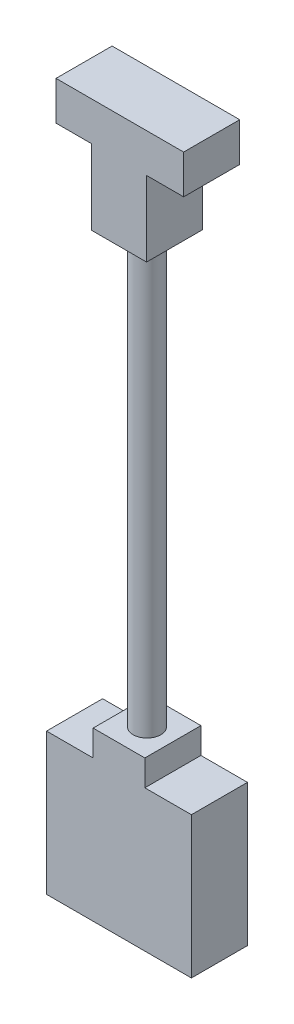
ISO-10303-21;
HEADER;
FILE_DESCRIPTION(('STEP AP214'),'2;1');
FILE_NAME('part.step','',(''),(''),'','','');
FILE_SCHEMA(('AUTOMOTIVE_DESIGN { 1 0 10303 214 1 1 1 1 }'));
ENDSEC;
DATA;
#1=APPLICATION_CONTEXT('core data for automotive mechanical design processes');
#2=APPLICATION_PROTOCOL_DEFINITION('international standard','automotive_design',2000,#1);
#3=PRODUCT_CONTEXT('',#1,'mechanical');
#4=PRODUCT('Part','Part','',(#3));
#5=PRODUCT_RELATED_PRODUCT_CATEGORY('part','',(#4));
#6=PRODUCT_DEFINITION_FORMATION('','',#4);
#7=PRODUCT_DEFINITION_CONTEXT('part definition',#1,'design');
#8=PRODUCT_DEFINITION('design','',#6,#7);
#9=PRODUCT_DEFINITION_SHAPE('','',#8);
#10=(LENGTH_UNIT() NAMED_UNIT(*) SI_UNIT(.MILLI.,.METRE.));
#11=(NAMED_UNIT(*) PLANE_ANGLE_UNIT() SI_UNIT($,.RADIAN.));
#12=(NAMED_UNIT(*) SI_UNIT($,.STERADIAN.) SOLID_ANGLE_UNIT());
#13=UNCERTAINTY_MEASURE_WITH_UNIT(LENGTH_MEASURE(1.E-05),#10,'distance_accuracy_value','');
#14=(GEOMETRIC_REPRESENTATION_CONTEXT(3) GLOBAL_UNCERTAINTY_ASSIGNED_CONTEXT((#13)) GLOBAL_UNIT_ASSIGNED_CONTEXT((#10,
#11,#12)) REPRESENTATION_CONTEXT('',''));
#15=CARTESIAN_POINT('',(0.,0.,0.));
#16=DIRECTION('',(0.,0.,1.));
#17=DIRECTION('',(1.,0.,0.));
#18=AXIS2_PLACEMENT_3D('',#15,#16,#17);
#19=CARTESIAN_POINT('',(16.5771568468043,-27.9499999999985,3.25));
#20=DIRECTION('',(0.,1.,0.));
#21=DIRECTION('',(0.,0.,1.));
#22=AXIS2_PLACEMENT_3D('',#19,#20,#21);
#23=CYLINDRICAL_SURFACE('',#22,1.6);
#24=CARTESIAN_POINT('',(16.5771568468043,27.0500000000015,3.25));
#25=DIRECTION('',(0.,-1.,0.));
#26=DIRECTION('',(0.,0.,-1.));
#27=AXIS2_PLACEMENT_3D('',#24,#25,#26);
#28=CIRCLE('',#27,1.6);
#29=CARTESIAN_POINT('',(16.5771568468043,27.0500000000015,1.65));
#30=VERTEX_POINT('',#29);
#31=EDGE_CURVE('E42',#30,#30,#28,.T.);
#32=ORIENTED_EDGE('',*,*,#31,.T.);
#33=EDGE_LOOP('',(#32));
#34=FACE_BOUND('',#33,.T.);
#35=CARTESIAN_POINT('',(16.5771568468043,-22.8500000000003,3.25));
#36=DIRECTION('',(0.,-1.,0.));
#37=DIRECTION('',(0.,0.,-1.));
#38=AXIS2_PLACEMENT_3D('',#35,#36,#37);
#39=CIRCLE('',#38,1.6);
#40=CARTESIAN_POINT('',(16.5771568468043,-22.8500000000003,1.65));
#41=VERTEX_POINT('',#40);
#42=EDGE_CURVE('E11',#41,#41,#39,.T.);
#43=ORIENTED_EDGE('',*,*,#42,.F.);
#44=EDGE_LOOP('',(#43));
#45=FACE_BOUND('',#44,.T.);
#46=ADVANCED_FACE('F33',(#34,#45),#23,.T.);
#47=CARTESIAN_POINT('',(13.3771568468043,27.0500000000015,6.5));
#48=DIRECTION('',(0.,1.,0.));
#49=DIRECTION('',(0.,0.,1.));
#50=AXIS2_PLACEMENT_3D('',#47,#48,#49);
#51=PLANE('',#50);
#52=ORIENTED_EDGE('',*,*,#31,.F.);
#53=EDGE_LOOP('',(#52));
#54=FACE_BOUND('',#53,.T.);
#55=DIRECTION('',(1.,0.,0.));
#56=VECTOR('',#55,1.);
#57=CARTESIAN_POINT('',(13.3771568468043,27.0500000000015,0.));
#58=LINE('',#57,#56);
#59=CARTESIAN_POINT('',(13.3771568468043,27.0500000000015,0.));
#60=VERTEX_POINT('',#59);
#61=CARTESIAN_POINT('',(19.7771568468043,27.0500000000015,0.));
#62=VERTEX_POINT('',#61);
#63=EDGE_CURVE('E135',#60,#62,#58,.T.);
#64=ORIENTED_EDGE('',*,*,#63,.T.);
#65=DIRECTION('',(0.,0.,-1.));
#66=VECTOR('',#65,1.);
#67=CARTESIAN_POINT('',(19.7771568468043,27.0500000000015,6.5));
#68=LINE('',#67,#66);
#69=CARTESIAN_POINT('',(19.7771568468043,27.0500000000015,6.5));
#70=VERTEX_POINT('',#69);
#71=EDGE_CURVE('E162',#70,#62,#68,.T.);
#72=ORIENTED_EDGE('',*,*,#71,.F.);
#73=DIRECTION('',(1.,0.,0.));
#74=VECTOR('',#73,1.);
#75=CARTESIAN_POINT('',(13.3771568468043,27.0500000000015,6.5));
#76=LINE('',#75,#74);
#77=CARTESIAN_POINT('',(13.3771568468043,27.0500000000015,6.5));
#78=VERTEX_POINT('',#77);
#79=EDGE_CURVE('E150',#78,#70,#76,.T.);
#80=ORIENTED_EDGE('',*,*,#79,.F.);
#81=DIRECTION('',(0.,0.,-1.));
#82=VECTOR('',#81,1.);
#83=CARTESIAN_POINT('',(13.3771568468043,27.0500000000015,6.5));
#84=LINE('',#83,#82);
#85=EDGE_CURVE('E131',#78,#60,#84,.T.);
#86=ORIENTED_EDGE('',*,*,#85,.T.);
#87=EDGE_LOOP('',(#64,#72,#80,#86));
#88=FACE_BOUND('',#87,.T.);
#89=ADVANCED_FACE('F35',(#54,#88),#51,.F.);
#90=CARTESIAN_POINT('',(19.7771568468043,27.0500000000015,6.5));
#91=DIRECTION('',(-1.,0.,0.));
#92=DIRECTION('',(0.,0.,1.));
#93=AXIS2_PLACEMENT_3D('',#90,#91,#92);
#94=PLANE('',#93);
#95=DIRECTION('',(0.,1.,0.));
#96=VECTOR('',#95,1.);
#97=CARTESIAN_POINT('',(19.7771568468043,27.0500000000015,0.));
#98=LINE('',#97,#96);
#99=CARTESIAN_POINT('',(19.7771568468043,35.7500000000015,0.));
#100=VERTEX_POINT('',#99);
#101=EDGE_CURVE('E138',#62,#100,#98,.T.);
#102=ORIENTED_EDGE('',*,*,#101,.T.);
#103=DIRECTION('',(0.,0.,-1.));
#104=VECTOR('',#103,1.);
#105=CARTESIAN_POINT('',(19.7771568468043,35.7500000000015,6.5));
#106=LINE('',#105,#104);
#107=CARTESIAN_POINT('',(19.7771568468043,35.7500000000015,6.5));
#108=VERTEX_POINT('',#107);
#109=EDGE_CURVE('E160',#108,#100,#106,.T.);
#110=ORIENTED_EDGE('',*,*,#109,.F.);
#111=DIRECTION('',(0.,1.,0.));
#112=VECTOR('',#111,1.);
#113=CARTESIAN_POINT('',(19.7771568468043,27.0500000000015,6.5));
#114=LINE('',#113,#112);
#115=EDGE_CURVE('E95',#70,#108,#114,.T.);
#116=ORIENTED_EDGE('',*,*,#115,.F.);
#117=ORIENTED_EDGE('',*,*,#71,.T.);
#118=EDGE_LOOP('',(#102,#110,#116,#117));
#119=FACE_BOUND('',#118,.T.);
#120=ADVANCED_FACE('F207',(#119),#94,.F.);
#121=CARTESIAN_POINT('',(19.7771568468043,35.7500000000015,6.5));
#122=DIRECTION('',(0.,1.,0.));
#123=DIRECTION('',(0.,0.,1.));
#124=AXIS2_PLACEMENT_3D('',#121,#122,#123);
#125=PLANE('',#124);
#126=DIRECTION('',(1.,0.,0.));
#127=VECTOR('',#126,1.);
#128=CARTESIAN_POINT('',(19.7771568468043,35.7500000000015,0.));
#129=LINE('',#128,#127);
#130=CARTESIAN_POINT('',(24.0771568468043,35.7500000000015,0.));
#131=VERTEX_POINT('',#130);
#132=EDGE_CURVE('E141',#100,#131,#129,.T.);
#133=ORIENTED_EDGE('',*,*,#132,.T.);
#134=DIRECTION('',(0.,0.,-1.));
#135=VECTOR('',#134,1.);
#136=CARTESIAN_POINT('',(24.0771568468043,35.7500000000015,6.5));
#137=LINE('',#136,#135);
#138=CARTESIAN_POINT('',(24.0771568468043,35.7500000000015,6.5));
#139=VERTEX_POINT('',#138);
#140=EDGE_CURVE('E157',#139,#131,#137,.T.);
#141=ORIENTED_EDGE('',*,*,#140,.F.);
#142=DIRECTION('',(1.,0.,0.));
#143=VECTOR('',#142,1.);
#144=CARTESIAN_POINT('',(19.7771568468043,35.7500000000015,6.5));
#145=LINE('',#144,#143);
#146=EDGE_CURVE('E173',#108,#139,#145,.T.);
#147=ORIENTED_EDGE('',*,*,#146,.F.);
#148=ORIENTED_EDGE('',*,*,#109,.T.);
#149=EDGE_LOOP('',(#133,#141,#147,#148));
#150=FACE_BOUND('',#149,.T.);
#151=ADVANCED_FACE('F485',(#150),#125,.F.);
#152=CARTESIAN_POINT('',(24.0771568468043,35.7500000000015,6.5));
#153=DIRECTION('',(-1.,0.,0.));
#154=DIRECTION('',(0.,0.,1.));
#155=AXIS2_PLACEMENT_3D('',#152,#153,#154);
#156=PLANE('',#155);
#157=DIRECTION('',(0.,1.,0.));
#158=VECTOR('',#157,1.);
#159=CARTESIAN_POINT('',(24.0771568468043,35.7500000000015,0.));
#160=LINE('',#159,#158);
#161=CARTESIAN_POINT('',(24.0771568468043,40.2500000000017,0.));
#162=VERTEX_POINT('',#161);
#163=EDGE_CURVE('E143',#131,#162,#160,.T.);
#164=ORIENTED_EDGE('',*,*,#163,.T.);
#165=DIRECTION('',(0.,0.,-1.));
#166=VECTOR('',#165,1.);
#167=CARTESIAN_POINT('',(24.0771568468043,40.2500000000017,6.5));
#168=LINE('',#167,#166);
#169=CARTESIAN_POINT('',(24.0771568468043,40.2500000000017,6.5));
#170=VERTEX_POINT('',#169);
#171=EDGE_CURVE('E154',#170,#162,#168,.T.);
#172=ORIENTED_EDGE('',*,*,#171,.F.);
#173=DIRECTION('',(0.,1.,0.));
#174=VECTOR('',#173,1.);
#175=CARTESIAN_POINT('',(24.0771568468043,35.7500000000015,6.5));
#176=LINE('',#175,#174);
#177=EDGE_CURVE('E175',#139,#170,#176,.T.);
#178=ORIENTED_EDGE('',*,*,#177,.F.);
#179=ORIENTED_EDGE('',*,*,#140,.T.);
#180=EDGE_LOOP('',(#164,#172,#178,#179));
#181=FACE_BOUND('',#180,.T.);
#182=ADVANCED_FACE('F181',(#181),#156,.F.);
#183=CARTESIAN_POINT('',(24.0771568468043,40.2500000000017,6.5));
#184=DIRECTION('',(0.,-1.,0.));
#185=DIRECTION('',(0.,0.,-1.));
#186=AXIS2_PLACEMENT_3D('',#183,#184,#185);
#187=PLANE('',#186);
#188=DIRECTION('',(-1.,0.,0.));
#189=VECTOR('',#188,1.);
#190=CARTESIAN_POINT('',(24.0771568468043,40.2500000000017,0.));
#191=LINE('',#190,#189);
#192=CARTESIAN_POINT('',(9.27715684680433,40.2500000000017,0.));
#193=VERTEX_POINT('',#192);
#194=EDGE_CURVE('E145',#162,#193,#191,.T.);
#195=ORIENTED_EDGE('',*,*,#194,.T.);
#196=DIRECTION('',(0.,0.,-1.));
#197=VECTOR('',#196,1.);
#198=CARTESIAN_POINT('',(9.27715684680433,40.2500000000017,6.5));
#199=LINE('',#198,#197);
#200=CARTESIAN_POINT('',(9.27715684680433,40.2500000000017,6.5));
#201=VERTEX_POINT('',#200);
#202=EDGE_CURVE('E126',#201,#193,#199,.T.);
#203=ORIENTED_EDGE('',*,*,#202,.F.);
#204=DIRECTION('',(-1.,0.,0.));
#205=VECTOR('',#204,1.);
#206=CARTESIAN_POINT('',(24.0771568468043,40.2500000000017,6.5));
#207=LINE('',#206,#205);
#208=EDGE_CURVE('E117',#170,#201,#207,.T.);
#209=ORIENTED_EDGE('',*,*,#208,.F.);
#210=ORIENTED_EDGE('',*,*,#171,.T.);
#211=EDGE_LOOP('',(#195,#203,#209,#210));
#212=FACE_BOUND('',#211,.T.);
#213=ADVANCED_FACE('F185',(#212),#187,.F.);
#214=CARTESIAN_POINT('',(9.27715684680433,40.2500000000017,6.5));
#215=DIRECTION('',(1.,0.,0.));
#216=DIRECTION('',(0.,0.,-1.));
#217=AXIS2_PLACEMENT_3D('',#214,#215,#216);
#218=PLANE('',#217);
#219=DIRECTION('',(0.,-1.,0.));
#220=VECTOR('',#219,1.);
#221=CARTESIAN_POINT('',(9.27715684680433,40.2500000000017,0.));
#222=LINE('',#221,#220);
#223=CARTESIAN_POINT('',(9.27715684680433,35.7500000000015,0.));
#224=VERTEX_POINT('',#223);
#225=EDGE_CURVE('E125',#193,#224,#222,.T.);
#226=ORIENTED_EDGE('',*,*,#225,.T.);
#227=DIRECTION('',(0.,0.,-1.));
#228=VECTOR('',#227,1.);
#229=CARTESIAN_POINT('',(9.27715684680433,35.7500000000015,6.5));
#230=LINE('',#229,#228);
#231=CARTESIAN_POINT('',(9.27715684680433,35.7500000000015,6.5));
#232=VERTEX_POINT('',#231);
#233=EDGE_CURVE('E122',#232,#224,#230,.T.);
#234=ORIENTED_EDGE('',*,*,#233,.F.);
#235=DIRECTION('',(0.,-1.,0.));
#236=VECTOR('',#235,1.);
#237=CARTESIAN_POINT('',(9.27715684680433,40.2500000000017,6.5));
#238=LINE('',#237,#236);
#239=EDGE_CURVE('E111',#201,#232,#238,.T.);
#240=ORIENTED_EDGE('',*,*,#239,.F.);
#241=ORIENTED_EDGE('',*,*,#202,.T.);
#242=EDGE_LOOP('',(#226,#234,#240,#241));
#243=FACE_BOUND('',#242,.T.);
#244=ADVANCED_FACE('F123',(#243),#218,.F.);
#245=CARTESIAN_POINT('',(9.27715684680433,35.7500000000015,6.5));
#246=DIRECTION('',(0.,1.,0.));
#247=DIRECTION('',(0.,0.,1.));
#248=AXIS2_PLACEMENT_3D('',#245,#246,#247);
#249=PLANE('',#248);
#250=DIRECTION('',(1.,0.,0.));
#251=VECTOR('',#250,1.);
#252=CARTESIAN_POINT('',(9.27715684680433,35.7500000000015,0.));
#253=LINE('',#252,#251);
#254=CARTESIAN_POINT('',(13.3771568468043,35.7500000000015,0.));
#255=VERTEX_POINT('',#254);
#256=EDGE_CURVE('E80',#224,#255,#253,.T.);
#257=ORIENTED_EDGE('',*,*,#256,.T.);
#258=DIRECTION('',(0.,0.,-1.));
#259=VECTOR('',#258,1.);
#260=CARTESIAN_POINT('',(13.3771568468043,35.7500000000015,6.5));
#261=LINE('',#260,#259);
#262=CARTESIAN_POINT('',(13.3771568468043,35.7500000000015,6.5));
#263=VERTEX_POINT('',#262);
#264=EDGE_CURVE('E127',#263,#255,#261,.T.);
#265=ORIENTED_EDGE('',*,*,#264,.F.);
#266=DIRECTION('',(1.,0.,0.));
#267=VECTOR('',#266,1.);
#268=CARTESIAN_POINT('',(9.27715684680433,35.7500000000015,6.5));
#269=LINE('',#268,#267);
#270=EDGE_CURVE('E115',#232,#263,#269,.T.);
#271=ORIENTED_EDGE('',*,*,#270,.F.);
#272=ORIENTED_EDGE('',*,*,#233,.T.);
#273=EDGE_LOOP('',(#257,#265,#271,#272));
#274=FACE_BOUND('',#273,.T.);
#275=ADVANCED_FACE('F129',(#274),#249,.F.);
#276=CARTESIAN_POINT('',(13.3771568468043,35.7500000000015,6.5));
#277=DIRECTION('',(1.,0.,0.));
#278=DIRECTION('',(0.,0.,-1.));
#279=AXIS2_PLACEMENT_3D('',#276,#277,#278);
#280=PLANE('',#279);
#281=DIRECTION('',(0.,-1.,0.));
#282=VECTOR('',#281,1.);
#283=CARTESIAN_POINT('',(13.3771568468043,35.7500000000015,0.));
#284=LINE('',#283,#282);
#285=EDGE_CURVE('E86',#255,#60,#284,.T.);
#286=ORIENTED_EDGE('',*,*,#285,.T.);
#287=ORIENTED_EDGE('',*,*,#85,.F.);
#288=DIRECTION('',(0.,-1.,0.));
#289=VECTOR('',#288,1.);
#290=CARTESIAN_POINT('',(13.3771568468043,35.7500000000015,6.5));
#291=LINE('',#290,#289);
#292=EDGE_CURVE('E50',#263,#78,#291,.T.);
#293=ORIENTED_EDGE('',*,*,#292,.F.);
#294=ORIENTED_EDGE('',*,*,#264,.T.);
#295=EDGE_LOOP('',(#286,#287,#293,#294));
#296=FACE_BOUND('',#295,.T.);
#297=ADVANCED_FACE('F192',(#296),#280,.F.);
#298=CARTESIAN_POINT('',(0.,0.,6.5));
#299=DIRECTION('',(0.,0.,1.));
#300=DIRECTION('',(1.,0.,0.));
#301=AXIS2_PLACEMENT_3D('',#298,#299,#300);
#302=PLANE('',#301);
#303=ORIENTED_EDGE('',*,*,#79,.T.);
#304=ORIENTED_EDGE('',*,*,#115,.T.);
#305=ORIENTED_EDGE('',*,*,#146,.T.);
#306=ORIENTED_EDGE('',*,*,#177,.T.);
#307=ORIENTED_EDGE('',*,*,#208,.T.);
#308=ORIENTED_EDGE('',*,*,#239,.T.);
#309=ORIENTED_EDGE('',*,*,#270,.T.);
#310=ORIENTED_EDGE('',*,*,#292,.T.);
#311=EDGE_LOOP('',(#303,#304,#305,#306,#307,#308,#309,#310));
#312=FACE_BOUND('',#311,.T.);
#313=ADVANCED_FACE('F113',(#312),#302,.T.);
#314=CARTESIAN_POINT('',(0.,0.,0.));
#315=DIRECTION('',(0.,0.,1.));
#316=DIRECTION('',(1.,0.,0.));
#317=AXIS2_PLACEMENT_3D('',#314,#315,#316);
#318=PLANE('',#317);
#319=ORIENTED_EDGE('',*,*,#63,.F.);
#320=ORIENTED_EDGE('',*,*,#285,.F.);
#321=ORIENTED_EDGE('',*,*,#256,.F.);
#322=ORIENTED_EDGE('',*,*,#225,.F.);
#323=ORIENTED_EDGE('',*,*,#194,.F.);
#324=ORIENTED_EDGE('',*,*,#163,.F.);
#325=ORIENTED_EDGE('',*,*,#132,.F.);
#326=ORIENTED_EDGE('',*,*,#101,.F.);
#327=EDGE_LOOP('',(#319,#320,#321,#322,#323,#324,#325,#326));
#328=FACE_BOUND('',#327,.T.);
#329=ADVANCED_FACE('F188',(#328),#318,.F.);
#330=CARTESIAN_POINT('',(8.17715684680399,-42.2500000000014,6.5));
#331=DIRECTION('',(0.,1.,0.));
#332=DIRECTION('',(0.,0.,1.));
#333=AXIS2_PLACEMENT_3D('',#330,#331,#332);
#334=PLANE('',#333);
#335=DIRECTION('',(1.,0.,0.));
#336=VECTOR('',#335,1.);
#337=CARTESIAN_POINT('',(8.17715684680399,-42.2500000000014,0.));
#338=LINE('',#337,#336);
#339=CARTESIAN_POINT('',(8.17715684680399,-42.2500000000014,0.));
#340=VERTEX_POINT('',#339);
#341=CARTESIAN_POINT('',(24.977156846804,-42.2500000000014,0.));
#342=VERTEX_POINT('',#341);
#343=EDGE_CURVE('E229',#340,#342,#338,.T.);
#344=ORIENTED_EDGE('',*,*,#343,.T.);
#345=DIRECTION('',(0.,0.,-1.));
#346=VECTOR('',#345,1.);
#347=CARTESIAN_POINT('',(24.977156846804,-42.2500000000014,6.5));
#348=LINE('',#347,#346);
#349=CARTESIAN_POINT('',(24.977156846804,-42.2500000000014,6.5));
#350=VERTEX_POINT('',#349);
#351=EDGE_CURVE('E139',#350,#342,#348,.T.);
#352=ORIENTED_EDGE('',*,*,#351,.F.);
#353=DIRECTION('',(1.,0.,0.));
#354=VECTOR('',#353,1.);
#355=CARTESIAN_POINT('',(8.17715684680399,-42.2500000000014,6.5));
#356=LINE('',#355,#354);
#357=CARTESIAN_POINT('',(8.17715684680399,-42.2500000000014,6.5));
#358=VERTEX_POINT('',#357);
#359=EDGE_CURVE('E266',#358,#350,#356,.T.);
#360=ORIENTED_EDGE('',*,*,#359,.F.);
#361=DIRECTION('',(0.,0.,-1.));
#362=VECTOR('',#361,1.);
#363=CARTESIAN_POINT('',(8.17715684680399,-42.2500000000014,6.5));
#364=LINE('',#363,#362);
#365=EDGE_CURVE('E234',#358,#340,#364,.T.);
#366=ORIENTED_EDGE('',*,*,#365,.T.);
#367=EDGE_LOOP('',(#344,#352,#360,#366));
#368=FACE_BOUND('',#367,.T.);
#369=ADVANCED_FACE('F211',(#368),#334,.F.);
#370=CARTESIAN_POINT('',(24.977156846804,-42.2500000000014,6.5));
#371=DIRECTION('',(-1.,0.,0.));
#372=DIRECTION('',(0.,0.,1.));
#373=AXIS2_PLACEMENT_3D('',#370,#371,#372);
#374=PLANE('',#373);
#375=DIRECTION('',(0.,1.,0.));
#376=VECTOR('',#375,1.);
#377=CARTESIAN_POINT('',(24.977156846804,-42.2500000000014,0.));
#378=LINE('',#377,#376);
#379=CARTESIAN_POINT('',(24.977156846804,-25.8500000000012,0.));
#380=VERTEX_POINT('',#379);
#381=EDGE_CURVE('E240',#342,#380,#378,.T.);
#382=ORIENTED_EDGE('',*,*,#381,.T.);
#383=DIRECTION('',(0.,0.,-1.));
#384=VECTOR('',#383,1.);
#385=CARTESIAN_POINT('',(24.977156846804,-25.8500000000012,6.5));
#386=LINE('',#385,#384);
#387=CARTESIAN_POINT('',(24.977156846804,-25.8500000000012,6.5));
#388=VERTEX_POINT('',#387);
#389=EDGE_CURVE('E282',#388,#380,#386,.T.);
#390=ORIENTED_EDGE('',*,*,#389,.F.);
#391=DIRECTION('',(0.,1.,0.));
#392=VECTOR('',#391,1.);
#393=CARTESIAN_POINT('',(24.977156846804,-42.2500000000014,6.5));
#394=LINE('',#393,#392);
#395=EDGE_CURVE('E290',#350,#388,#394,.T.);
#396=ORIENTED_EDGE('',*,*,#395,.F.);
#397=ORIENTED_EDGE('',*,*,#351,.T.);
#398=EDGE_LOOP('',(#382,#390,#396,#397));
#399=FACE_BOUND('',#398,.T.);
#400=ADVANCED_FACE('F217',(#399),#374,.F.);
#401=CARTESIAN_POINT('',(24.977156846804,-25.8500000000012,6.5));
#402=DIRECTION('',(0.,-1.,0.));
#403=DIRECTION('',(0.,0.,-1.));
#404=AXIS2_PLACEMENT_3D('',#401,#402,#403);
#405=PLANE('',#404);
#406=DIRECTION('',(-1.,0.,0.));
#407=VECTOR('',#406,1.);
#408=CARTESIAN_POINT('',(24.977156846804,-25.8500000000012,0.));
#409=LINE('',#408,#407);
#410=CARTESIAN_POINT('',(19.577156846804,-25.8500000000012,0.));
#411=VERTEX_POINT('',#410);
#412=EDGE_CURVE('E243',#380,#411,#409,.T.);
#413=ORIENTED_EDGE('',*,*,#412,.T.);
#414=DIRECTION('',(0.,0.,-1.));
#415=VECTOR('',#414,1.);
#416=CARTESIAN_POINT('',(19.577156846804,-25.8500000000012,6.5));
#417=LINE('',#416,#415);
#418=CARTESIAN_POINT('',(19.577156846804,-25.8500000000012,6.5));
#419=VERTEX_POINT('',#418);
#420=EDGE_CURVE('E280',#419,#411,#417,.T.);
#421=ORIENTED_EDGE('',*,*,#420,.F.);
#422=DIRECTION('',(-1.,0.,0.));
#423=VECTOR('',#422,1.);
#424=CARTESIAN_POINT('',(24.977156846804,-25.8500000000012,6.5));
#425=LINE('',#424,#423);
#426=EDGE_CURVE('E296',#388,#419,#425,.T.);
#427=ORIENTED_EDGE('',*,*,#426,.F.);
#428=ORIENTED_EDGE('',*,*,#389,.T.);
#429=EDGE_LOOP('',(#413,#421,#427,#428));
#430=FACE_BOUND('',#429,.T.);
#431=ADVANCED_FACE('F222',(#430),#405,.F.);
#432=CARTESIAN_POINT('',(19.577156846804,-25.8500000000012,6.5));
#433=DIRECTION('',(-1.,0.,0.));
#434=DIRECTION('',(0.,0.,1.));
#435=AXIS2_PLACEMENT_3D('',#432,#433,#434);
#436=PLANE('',#435);
#437=DIRECTION('',(0.,1.,0.));
#438=VECTOR('',#437,1.);
#439=CARTESIAN_POINT('',(19.577156846804,-25.8500000000012,0.));
#440=LINE('',#439,#438);
#441=CARTESIAN_POINT('',(19.577156846804,-22.8500000000003,0.));
#442=VERTEX_POINT('',#441);
#443=EDGE_CURVE('E251',#411,#442,#440,.T.);
#444=ORIENTED_EDGE('',*,*,#443,.T.);
#445=DIRECTION('',(0.,0.,-1.));
#446=VECTOR('',#445,1.);
#447=CARTESIAN_POINT('',(19.577156846804,-22.8500000000003,6.5));
#448=LINE('',#447,#446);
#449=CARTESIAN_POINT('',(19.577156846804,-22.8500000000003,6.5));
#450=VERTEX_POINT('',#449);
#451=EDGE_CURVE('E277',#450,#442,#448,.T.);
#452=ORIENTED_EDGE('',*,*,#451,.F.);
#453=DIRECTION('',(0.,1.,0.));
#454=VECTOR('',#453,1.);
#455=CARTESIAN_POINT('',(19.577156846804,-25.8500000000012,6.5));
#456=LINE('',#455,#454);
#457=EDGE_CURVE('E305',#419,#450,#456,.T.);
#458=ORIENTED_EDGE('',*,*,#457,.F.);
#459=ORIENTED_EDGE('',*,*,#420,.T.);
#460=EDGE_LOOP('',(#444,#452,#458,#459));
#461=FACE_BOUND('',#460,.T.);
#462=ADVANCED_FACE('F360',(#461),#436,.F.);
#463=CARTESIAN_POINT('',(19.577156846804,-22.8500000000003,6.5));
#464=DIRECTION('',(0.,-1.,0.));
#465=DIRECTION('',(0.,0.,-1.));
#466=AXIS2_PLACEMENT_3D('',#463,#464,#465);
#467=PLANE('',#466);
#468=ORIENTED_EDGE('',*,*,#42,.T.);
#469=EDGE_LOOP('',(#468));
#470=FACE_BOUND('',#469,.T.);
#471=DIRECTION('',(-1.,0.,0.));
#472=VECTOR('',#471,1.);
#473=CARTESIAN_POINT('',(19.577156846804,-22.8500000000003,0.));
#474=LINE('',#473,#472);
#475=CARTESIAN_POINT('',(13.577156846804,-22.8500000000003,0.));
#476=VERTEX_POINT('',#475);
#477=EDGE_CURVE('E254',#442,#476,#474,.T.);
#478=ORIENTED_EDGE('',*,*,#477,.T.);
#479=DIRECTION('',(0.,0.,-1.));
#480=VECTOR('',#479,1.);
#481=CARTESIAN_POINT('',(13.577156846804,-22.8500000000003,6.5));
#482=LINE('',#481,#480);
#483=CARTESIAN_POINT('',(13.577156846804,-22.8500000000003,6.5));
#484=VERTEX_POINT('',#483);
#485=EDGE_CURVE('E274',#484,#476,#482,.T.);
#486=ORIENTED_EDGE('',*,*,#485,.F.);
#487=DIRECTION('',(-1.,0.,0.));
#488=VECTOR('',#487,1.);
#489=CARTESIAN_POINT('',(19.577156846804,-22.8500000000003,6.5));
#490=LINE('',#489,#488);
#491=EDGE_CURVE('E308',#450,#484,#490,.T.);
#492=ORIENTED_EDGE('',*,*,#491,.F.);
#493=ORIENTED_EDGE('',*,*,#451,.T.);
#494=EDGE_LOOP('',(#478,#486,#492,#493));
#495=FACE_BOUND('',#494,.T.);
#496=ADVANCED_FACE('F357',(#470,#495),#467,.F.);
#497=CARTESIAN_POINT('',(13.577156846804,-22.8500000000003,6.5));
#498=DIRECTION('',(1.,0.,0.));
#499=DIRECTION('',(0.,0.,-1.));
#500=AXIS2_PLACEMENT_3D('',#497,#498,#499);
#501=PLANE('',#500);
#502=DIRECTION('',(0.,-1.,0.));
#503=VECTOR('',#502,1.);
#504=CARTESIAN_POINT('',(13.577156846804,-22.8500000000003,0.));
#505=LINE('',#504,#503);
#506=CARTESIAN_POINT('',(13.577156846804,-25.8500000000012,0.));
#507=VERTEX_POINT('',#506);
#508=EDGE_CURVE('E257',#476,#507,#505,.T.);
#509=ORIENTED_EDGE('',*,*,#508,.T.);
#510=DIRECTION('',(0.,0.,-1.));
#511=VECTOR('',#510,1.);
#512=CARTESIAN_POINT('',(13.577156846804,-25.8500000000012,6.5));
#513=LINE('',#512,#511);
#514=CARTESIAN_POINT('',(13.577156846804,-25.8500000000012,6.5));
#515=VERTEX_POINT('',#514);
#516=EDGE_CURVE('E271',#515,#507,#513,.T.);
#517=ORIENTED_EDGE('',*,*,#516,.F.);
#518=DIRECTION('',(0.,-1.,0.));
#519=VECTOR('',#518,1.);
#520=CARTESIAN_POINT('',(13.577156846804,-22.8500000000003,6.5));
#521=LINE('',#520,#519);
#522=EDGE_CURVE('E311',#484,#515,#521,.T.);
#523=ORIENTED_EDGE('',*,*,#522,.F.);
#524=ORIENTED_EDGE('',*,*,#485,.T.);
#525=EDGE_LOOP('',(#509,#517,#523,#524));
#526=FACE_BOUND('',#525,.T.);
#527=ADVANCED_FACE('F340',(#526),#501,.F.);
#528=CARTESIAN_POINT('',(13.577156846804,-25.8500000000012,6.5));
#529=DIRECTION('',(0.,-1.,0.));
#530=DIRECTION('',(0.,0.,-1.));
#531=AXIS2_PLACEMENT_3D('',#528,#529,#530);
#532=PLANE('',#531);
#533=DIRECTION('',(-1.,0.,0.));
#534=VECTOR('',#533,1.);
#535=CARTESIAN_POINT('',(13.577156846804,-25.8500000000012,0.));
#536=LINE('',#535,#534);
#537=CARTESIAN_POINT('',(8.17715684680399,-25.8500000000012,0.));
#538=VERTEX_POINT('',#537);
#539=EDGE_CURVE('E260',#507,#538,#536,.T.);
#540=ORIENTED_EDGE('',*,*,#539,.T.);
#541=DIRECTION('',(0.,0.,-1.));
#542=VECTOR('',#541,1.);
#543=CARTESIAN_POINT('',(8.17715684680399,-25.8500000000012,6.5));
#544=LINE('',#543,#542);
#545=CARTESIAN_POINT('',(8.17715684680399,-25.8500000000012,6.5));
#546=VERTEX_POINT('',#545);
#547=EDGE_CURVE('E268',#546,#538,#544,.T.);
#548=ORIENTED_EDGE('',*,*,#547,.F.);
#549=DIRECTION('',(-1.,0.,0.));
#550=VECTOR('',#549,1.);
#551=CARTESIAN_POINT('',(13.577156846804,-25.8500000000012,6.5));
#552=LINE('',#551,#550);
#553=EDGE_CURVE('E313',#515,#546,#552,.T.);
#554=ORIENTED_EDGE('',*,*,#553,.F.);
#555=ORIENTED_EDGE('',*,*,#516,.T.);
#556=EDGE_LOOP('',(#540,#548,#554,#555));
#557=FACE_BOUND('',#556,.T.);
#558=ADVANCED_FACE('F322',(#557),#532,.F.);
#559=CARTESIAN_POINT('',(8.17715684680399,-25.8500000000012,6.5));
#560=DIRECTION('',(1.,0.,0.));
#561=DIRECTION('',(0.,0.,-1.));
#562=AXIS2_PLACEMENT_3D('',#559,#560,#561);
#563=PLANE('',#562);
#564=DIRECTION('',(0.,-1.,0.));
#565=VECTOR('',#564,1.);
#566=CARTESIAN_POINT('',(8.17715684680399,-25.8500000000012,0.));
#567=LINE('',#566,#565);
#568=EDGE_CURVE('E263',#538,#340,#567,.T.);
#569=ORIENTED_EDGE('',*,*,#568,.T.);
#570=ORIENTED_EDGE('',*,*,#365,.F.);
#571=DIRECTION('',(0.,-1.,0.));
#572=VECTOR('',#571,1.);
#573=CARTESIAN_POINT('',(8.17715684680399,-25.8500000000012,6.5));
#574=LINE('',#573,#572);
#575=EDGE_CURVE('E246',#546,#358,#574,.T.);
#576=ORIENTED_EDGE('',*,*,#575,.F.);
#577=ORIENTED_EDGE('',*,*,#547,.T.);
#578=EDGE_LOOP('',(#569,#570,#576,#577));
#579=FACE_BOUND('',#578,.T.);
#580=ADVANCED_FACE('F326',(#579),#563,.F.);
#581=CARTESIAN_POINT('',(0.,0.,6.5));
#582=DIRECTION('',(0.,0.,1.));
#583=DIRECTION('',(1.,0.,0.));
#584=AXIS2_PLACEMENT_3D('',#581,#582,#583);
#585=PLANE('',#584);
#586=ORIENTED_EDGE('',*,*,#359,.T.);
#587=ORIENTED_EDGE('',*,*,#395,.T.);
#588=ORIENTED_EDGE('',*,*,#426,.T.);
#589=ORIENTED_EDGE('',*,*,#457,.T.);
#590=ORIENTED_EDGE('',*,*,#491,.T.);
#591=ORIENTED_EDGE('',*,*,#522,.T.);
#592=ORIENTED_EDGE('',*,*,#553,.T.);
#593=ORIENTED_EDGE('',*,*,#575,.T.);
#594=EDGE_LOOP('',(#586,#587,#588,#589,#590,#591,#592,#593));
#595=FACE_BOUND('',#594,.T.);
#596=ADVANCED_FACE('F299',(#595),#585,.T.);
#597=CARTESIAN_POINT('',(0.,0.,0.));
#598=DIRECTION('',(0.,0.,1.));
#599=DIRECTION('',(1.,0.,0.));
#600=AXIS2_PLACEMENT_3D('',#597,#598,#599);
#601=PLANE('',#600);
#602=ORIENTED_EDGE('',*,*,#343,.F.);
#603=ORIENTED_EDGE('',*,*,#568,.F.);
#604=ORIENTED_EDGE('',*,*,#539,.F.);
#605=ORIENTED_EDGE('',*,*,#508,.F.);
#606=ORIENTED_EDGE('',*,*,#477,.F.);
#607=ORIENTED_EDGE('',*,*,#443,.F.);
#608=ORIENTED_EDGE('',*,*,#412,.F.);
#609=ORIENTED_EDGE('',*,*,#381,.F.);
#610=EDGE_LOOP('',(#602,#603,#604,#605,#606,#607,#608,#609));
#611=FACE_BOUND('',#610,.T.);
#612=ADVANCED_FACE('F343',(#611),#601,.F.);
#613=CLOSED_SHELL('',(#46,#89,#120,#151,#182,#213,#244,#275,#297,#313,#329,#369,#400,#431,#462,
#496,#527,#558,#580,#596,#612));
#614=MANIFOLD_SOLID_BREP('B2',#613);
#615=ADVANCED_BREP_SHAPE_REPRESENTATION('',(#18,#614),#14);
#616=SHAPE_DEFINITION_REPRESENTATION(#9,#615);
ENDSEC;
END-ISO-10303-21;
